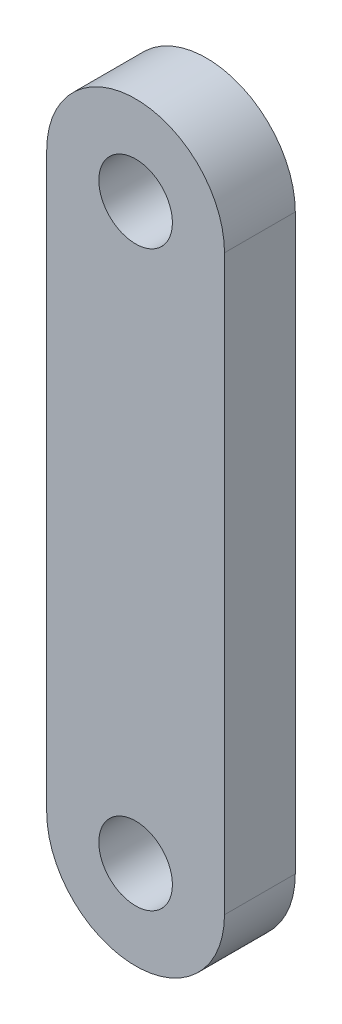
ISO-10303-21;
HEADER;
FILE_DESCRIPTION(('STEP AP214'),'2;1');
FILE_NAME('part.step','',(''),(''),'','','');
FILE_SCHEMA(('AUTOMOTIVE_DESIGN { 1 0 10303 214 1 1 1 1 }'));
ENDSEC;
DATA;
#1=APPLICATION_CONTEXT('core data for automotive mechanical design processes');
#2=APPLICATION_PROTOCOL_DEFINITION('international standard','automotive_design',2000,#1);
#3=PRODUCT_CONTEXT('',#1,'mechanical');
#4=PRODUCT('Part','Part','',(#3));
#5=PRODUCT_RELATED_PRODUCT_CATEGORY('part','',(#4));
#6=PRODUCT_DEFINITION_FORMATION('','',#4);
#7=PRODUCT_DEFINITION_CONTEXT('part definition',#1,'design');
#8=PRODUCT_DEFINITION('design','',#6,#7);
#9=PRODUCT_DEFINITION_SHAPE('','',#8);
#10=(LENGTH_UNIT() NAMED_UNIT(*) SI_UNIT(.MILLI.,.METRE.));
#11=(NAMED_UNIT(*) PLANE_ANGLE_UNIT() SI_UNIT($,.RADIAN.));
#12=(NAMED_UNIT(*) SI_UNIT($,.STERADIAN.) SOLID_ANGLE_UNIT());
#13=UNCERTAINTY_MEASURE_WITH_UNIT(LENGTH_MEASURE(1.E-05),#10,'distance_accuracy_value','');
#14=(GEOMETRIC_REPRESENTATION_CONTEXT(3) GLOBAL_UNCERTAINTY_ASSIGNED_CONTEXT((#13)) GLOBAL_UNIT_ASSIGNED_CONTEXT((#10,
#11,#12)) REPRESENTATION_CONTEXT('',''));
#15=CARTESIAN_POINT('',(0.,0.,0.));
#16=DIRECTION('',(0.,0.,1.));
#17=DIRECTION('',(1.,0.,0.));
#18=AXIS2_PLACEMENT_3D('',#15,#16,#17);
#19=CARTESIAN_POINT('',(0.,38.0750020317063,6.35));
#20=DIRECTION('',(0.,0.,1.));
#21=DIRECTION('',(1.,0.,0.));
#22=AXIS2_PLACEMENT_3D('',#19,#20,#21);
#23=PLANE('',#22);
#24=CARTESIAN_POINT('',(0.,38.0750020317063,6.35));
#25=DIRECTION('',(0.,0.,1.));
#26=DIRECTION('',(1.,0.,0.));
#27=AXIS2_PLACEMENT_3D('',#24,#25,#26);
#28=CIRCLE('',#27,3.302);
#29=CARTESIAN_POINT('',(3.302,38.0750020317063,6.35));
#30=VERTEX_POINT('',#29);
#31=EDGE_CURVE('E99',#30,#30,#28,.T.);
#32=ORIENTED_EDGE('',*,*,#31,.F.);
#33=EDGE_LOOP('',(#32));
#34=FACE_BOUND('',#33,.T.);
#35=CARTESIAN_POINT('',(0.,38.0750020317063,6.35));
#36=DIRECTION('',(0.,0.,1.));
#37=DIRECTION('',(1.,0.,0.));
#38=AXIS2_PLACEMENT_3D('',#35,#36,#37);
#39=CIRCLE('',#38,7.9756);
#40=CARTESIAN_POINT('',(7.9756,38.0750020317063,6.35));
#41=VERTEX_POINT('',#40);
#42=CARTESIAN_POINT('',(-7.9756,38.0750020317063,6.35));
#43=VERTEX_POINT('',#42);
#44=EDGE_CURVE('E84',#41,#43,#39,.T.);
#45=ORIENTED_EDGE('',*,*,#44,.T.);
#46=DIRECTION('',(0.,-1.,0.));
#47=VECTOR('',#46,1.);
#48=CARTESIAN_POINT('',(-7.9756,38.0750020317063,6.35));
#49=LINE('',#48,#47);
#50=CARTESIAN_POINT('',(-7.9756,-13.3599979682937,6.35));
#51=VERTEX_POINT('',#50);
#52=EDGE_CURVE('E79',#43,#51,#49,.T.);
#53=ORIENTED_EDGE('',*,*,#52,.T.);
#54=CARTESIAN_POINT('',(0.,-13.3599979682937,6.35));
#55=DIRECTION('',(0.,0.,1.));
#56=DIRECTION('',(1.,0.,0.));
#57=AXIS2_PLACEMENT_3D('',#54,#55,#56);
#58=CIRCLE('',#57,7.9756);
#59=CARTESIAN_POINT('',(7.97560000000001,-13.3599979682937,6.35));
#60=VERTEX_POINT('',#59);
#61=EDGE_CURVE('E82',#51,#60,#58,.T.);
#62=ORIENTED_EDGE('',*,*,#61,.T.);
#63=DIRECTION('',(0.,1.,0.));
#64=VECTOR('',#63,1.);
#65=CARTESIAN_POINT('',(7.9756,38.0750020317063,6.35));
#66=LINE('',#65,#64);
#67=EDGE_CURVE('E49',#60,#41,#66,.T.);
#68=ORIENTED_EDGE('',*,*,#67,.T.);
#69=EDGE_LOOP('',(#45,#53,#62,#68));
#70=FACE_BOUND('',#69,.T.);
#71=CARTESIAN_POINT('',(0.,-13.3599979682937,6.35));
#72=DIRECTION('',(0.,0.,1.));
#73=DIRECTION('',(1.,0.,0.));
#74=AXIS2_PLACEMENT_3D('',#71,#72,#73);
#75=CIRCLE('',#74,3.302);
#76=CARTESIAN_POINT('',(3.302,-13.3599979682937,6.35));
#77=VERTEX_POINT('',#76);
#78=EDGE_CURVE('E114',#77,#77,#75,.T.);
#79=ORIENTED_EDGE('',*,*,#78,.F.);
#80=EDGE_LOOP('',(#79));
#81=FACE_BOUND('',#80,.T.);
#82=ADVANCED_FACE('F32',(#34,#70,#81),#23,.T.);
#83=CARTESIAN_POINT('',(0.,38.0750020317063,0.));
#84=DIRECTION('',(0.,0.,1.));
#85=DIRECTION('',(1.,0.,0.));
#86=AXIS2_PLACEMENT_3D('',#83,#84,#85);
#87=PLANE('',#86);
#88=CARTESIAN_POINT('',(0.,38.0750020317063,0.));
#89=DIRECTION('',(0.,0.,1.));
#90=DIRECTION('',(1.,0.,0.));
#91=AXIS2_PLACEMENT_3D('',#88,#89,#90);
#92=CIRCLE('',#91,7.9756);
#93=CARTESIAN_POINT('',(7.9756,38.0750020317063,0.));
#94=VERTEX_POINT('',#93);
#95=CARTESIAN_POINT('',(-7.9756,38.0750020317063,0.));
#96=VERTEX_POINT('',#95);
#97=EDGE_CURVE('E96',#94,#96,#92,.T.);
#98=ORIENTED_EDGE('',*,*,#97,.F.);
#99=DIRECTION('',(0.,1.,0.));
#100=VECTOR('',#99,1.);
#101=CARTESIAN_POINT('',(7.9756,38.0750020317063,0.));
#102=LINE('',#101,#100);
#103=CARTESIAN_POINT('',(7.97560000000001,-13.3599979682937,0.));
#104=VERTEX_POINT('',#103);
#105=EDGE_CURVE('E72',#104,#94,#102,.T.);
#106=ORIENTED_EDGE('',*,*,#105,.F.);
#107=CARTESIAN_POINT('',(0.,-13.3599979682937,0.));
#108=DIRECTION('',(0.,0.,1.));
#109=DIRECTION('',(1.,0.,0.));
#110=AXIS2_PLACEMENT_3D('',#107,#108,#109);
#111=CIRCLE('',#110,7.9756);
#112=CARTESIAN_POINT('',(-7.9756,-13.3599979682937,0.));
#113=VERTEX_POINT('',#112);
#114=EDGE_CURVE('E66',#113,#104,#111,.T.);
#115=ORIENTED_EDGE('',*,*,#114,.F.);
#116=DIRECTION('',(0.,-1.,0.));
#117=VECTOR('',#116,1.);
#118=CARTESIAN_POINT('',(-7.9756,38.0750020317063,0.));
#119=LINE('',#118,#117);
#120=EDGE_CURVE('E88',#96,#113,#119,.T.);
#121=ORIENTED_EDGE('',*,*,#120,.F.);
#122=EDGE_LOOP('',(#98,#106,#115,#121));
#123=FACE_BOUND('',#122,.T.);
#124=CARTESIAN_POINT('',(0.,38.0750020317063,0.));
#125=DIRECTION('',(0.,0.,1.));
#126=DIRECTION('',(1.,0.,0.));
#127=AXIS2_PLACEMENT_3D('',#124,#125,#126);
#128=CIRCLE('',#127,3.302);
#129=CARTESIAN_POINT('',(3.302,38.0750020317063,0.));
#130=VERTEX_POINT('',#129);
#131=EDGE_CURVE('E111',#130,#130,#128,.T.);
#132=ORIENTED_EDGE('',*,*,#131,.T.);
#133=EDGE_LOOP('',(#132));
#134=FACE_BOUND('',#133,.T.);
#135=CARTESIAN_POINT('',(0.,-13.3599979682937,0.));
#136=DIRECTION('',(0.,0.,1.));
#137=DIRECTION('',(1.,0.,0.));
#138=AXIS2_PLACEMENT_3D('',#135,#136,#137);
#139=CIRCLE('',#138,3.302);
#140=CARTESIAN_POINT('',(3.302,-13.3599979682937,0.));
#141=VERTEX_POINT('',#140);
#142=EDGE_CURVE('E117',#141,#141,#139,.T.);
#143=ORIENTED_EDGE('',*,*,#142,.T.);
#144=EDGE_LOOP('',(#143));
#145=FACE_BOUND('',#144,.T.);
#146=ADVANCED_FACE('F107',(#123,#134,#145),#87,.F.);
#147=CARTESIAN_POINT('',(0.,38.0750020317063,6.35));
#148=DIRECTION('',(0.,0.,-1.));
#149=DIRECTION('',(-1.,0.,0.));
#150=AXIS2_PLACEMENT_3D('',#147,#148,#149);
#151=CYLINDRICAL_SURFACE('',#150,7.9756);
#152=ORIENTED_EDGE('',*,*,#97,.T.);
#153=DIRECTION('',(0.,0.,-1.));
#154=VECTOR('',#153,1.);
#155=CARTESIAN_POINT('',(-7.9756,38.0750020317063,6.35));
#156=LINE('',#155,#154);
#157=EDGE_CURVE('E11',#43,#96,#156,.T.);
#158=ORIENTED_EDGE('',*,*,#157,.F.);
#159=ORIENTED_EDGE('',*,*,#44,.F.);
#160=DIRECTION('',(0.,0.,-1.));
#161=VECTOR('',#160,1.);
#162=CARTESIAN_POINT('',(7.9756,38.0750020317063,6.35));
#163=LINE('',#162,#161);
#164=EDGE_CURVE('E92',#41,#94,#163,.T.);
#165=ORIENTED_EDGE('',*,*,#164,.T.);
#166=EDGE_LOOP('',(#152,#158,#159,#165));
#167=FACE_BOUND('',#166,.T.);
#168=ADVANCED_FACE('F34',(#167),#151,.T.);
#169=CARTESIAN_POINT('',(-7.9756,38.0750020317063,6.35));
#170=DIRECTION('',(1.,0.,0.));
#171=DIRECTION('',(0.,1.,0.));
#172=AXIS2_PLACEMENT_3D('',#169,#170,#171);
#173=PLANE('',#172);
#174=ORIENTED_EDGE('',*,*,#120,.T.);
#175=DIRECTION('',(0.,0.,-1.));
#176=VECTOR('',#175,1.);
#177=CARTESIAN_POINT('',(-7.9756,-13.3599979682937,6.35));
#178=LINE('',#177,#176);
#179=EDGE_CURVE('E41',#51,#113,#178,.T.);
#180=ORIENTED_EDGE('',*,*,#179,.F.);
#181=ORIENTED_EDGE('',*,*,#52,.F.);
#182=ORIENTED_EDGE('',*,*,#157,.T.);
#183=EDGE_LOOP('',(#174,#180,#181,#182));
#184=FACE_BOUND('',#183,.T.);
#185=ADVANCED_FACE('F87',(#184),#173,.F.);
#186=CARTESIAN_POINT('',(0.,-13.3599979682937,6.35));
#187=DIRECTION('',(0.,0.,-1.));
#188=DIRECTION('',(-1.,0.,0.));
#189=AXIS2_PLACEMENT_3D('',#186,#187,#188);
#190=CYLINDRICAL_SURFACE('',#189,7.9756);
#191=ORIENTED_EDGE('',*,*,#114,.T.);
#192=DIRECTION('',(0.,0.,-1.));
#193=VECTOR('',#192,1.);
#194=CARTESIAN_POINT('',(7.97560000000001,-13.3599979682937,6.35));
#195=LINE('',#194,#193);
#196=EDGE_CURVE('E89',#60,#104,#195,.T.);
#197=ORIENTED_EDGE('',*,*,#196,.F.);
#198=ORIENTED_EDGE('',*,*,#61,.F.);
#199=ORIENTED_EDGE('',*,*,#179,.T.);
#200=EDGE_LOOP('',(#191,#197,#198,#199));
#201=FACE_BOUND('',#200,.T.);
#202=ADVANCED_FACE('F90',(#201),#190,.T.);
#203=CARTESIAN_POINT('',(7.9756,38.0750020317063,6.35));
#204=DIRECTION('',(-1.,0.,0.));
#205=DIRECTION('',(0.,-1.,0.));
#206=AXIS2_PLACEMENT_3D('',#203,#204,#205);
#207=PLANE('',#206);
#208=ORIENTED_EDGE('',*,*,#105,.T.);
#209=ORIENTED_EDGE('',*,*,#164,.F.);
#210=ORIENTED_EDGE('',*,*,#67,.F.);
#211=ORIENTED_EDGE('',*,*,#196,.T.);
#212=EDGE_LOOP('',(#208,#209,#210,#211));
#213=FACE_BOUND('',#212,.T.);
#214=ADVANCED_FACE('F104',(#213),#207,.F.);
#215=CARTESIAN_POINT('',(0.,38.0750020317063,6.35));
#216=DIRECTION('',(0.,0.,-1.));
#217=DIRECTION('',(-1.,0.,0.));
#218=AXIS2_PLACEMENT_3D('',#215,#216,#217);
#219=CYLINDRICAL_SURFACE('',#218,3.302);
#220=ORIENTED_EDGE('',*,*,#31,.T.);
#221=EDGE_LOOP('',(#220));
#222=FACE_BOUND('',#221,.T.);
#223=ORIENTED_EDGE('',*,*,#131,.F.);
#224=EDGE_LOOP('',(#223));
#225=FACE_BOUND('',#224,.T.);
#226=ADVANCED_FACE('F134',(#222,#225),#219,.F.);
#227=CARTESIAN_POINT('',(0.,-13.3599979682937,6.35));
#228=DIRECTION('',(0.,0.,-1.));
#229=DIRECTION('',(-1.,0.,0.));
#230=AXIS2_PLACEMENT_3D('',#227,#228,#229);
#231=CYLINDRICAL_SURFACE('',#230,3.302);
#232=ORIENTED_EDGE('',*,*,#78,.T.);
#233=EDGE_LOOP('',(#232));
#234=FACE_BOUND('',#233,.T.);
#235=ORIENTED_EDGE('',*,*,#142,.F.);
#236=EDGE_LOOP('',(#235));
#237=FACE_BOUND('',#236,.T.);
#238=ADVANCED_FACE('F123',(#234,#237),#231,.F.);
#239=CLOSED_SHELL('',(#82,#146,#168,#185,#202,#214,#226,#238));
#240=MANIFOLD_SOLID_BREP('B2',#239);
#241=ADVANCED_BREP_SHAPE_REPRESENTATION('',(#18,#240),#14);
#242=SHAPE_DEFINITION_REPRESENTATION(#9,#241);
ENDSEC;
END-ISO-10303-21;
